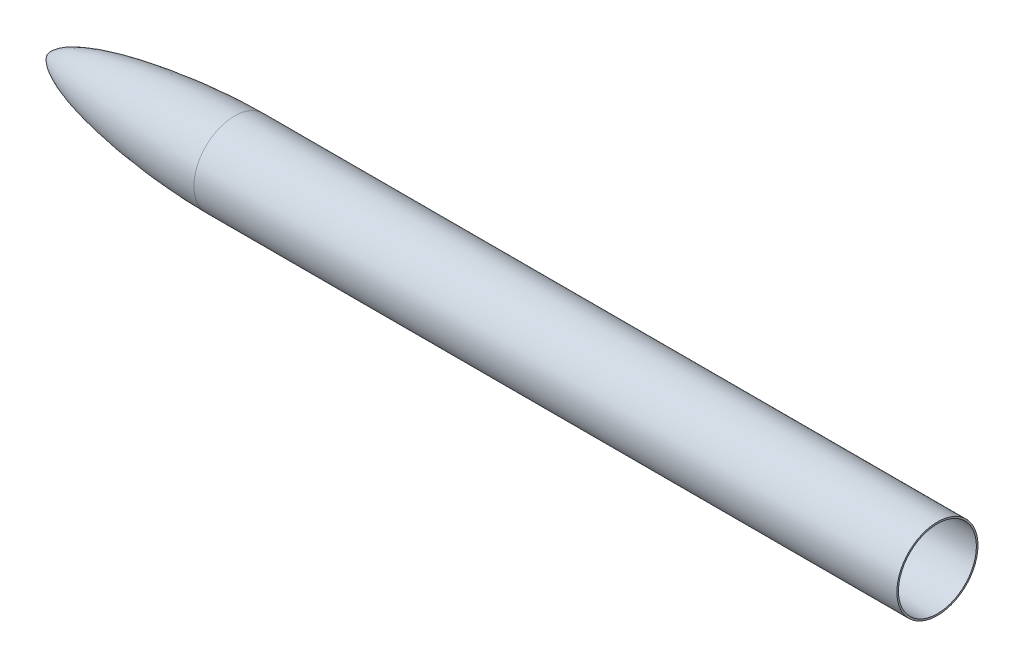
ISO-10303-21;
HEADER;
FILE_DESCRIPTION(('STEP AP214'),'2;1');
FILE_NAME('part.step','',(''),(''),'','','');
FILE_SCHEMA(('AUTOMOTIVE_DESIGN { 1 0 10303 214 1 1 1 1 }'));
ENDSEC;
DATA;
#1=APPLICATION_CONTEXT('core data for automotive mechanical design processes');
#2=APPLICATION_PROTOCOL_DEFINITION('international standard','automotive_design',2000,#1);
#3=PRODUCT_CONTEXT('',#1,'mechanical');
#4=PRODUCT('Part','Part','',(#3));
#5=PRODUCT_RELATED_PRODUCT_CATEGORY('part','',(#4));
#6=PRODUCT_DEFINITION_FORMATION('','',#4);
#7=PRODUCT_DEFINITION_CONTEXT('part definition',#1,'design');
#8=PRODUCT_DEFINITION('design','',#6,#7);
#9=PRODUCT_DEFINITION_SHAPE('','',#8);
#10=(LENGTH_UNIT() NAMED_UNIT(*) SI_UNIT(.MILLI.,.METRE.));
#11=(NAMED_UNIT(*) PLANE_ANGLE_UNIT() SI_UNIT($,.RADIAN.));
#12=(NAMED_UNIT(*) SI_UNIT($,.STERADIAN.) SOLID_ANGLE_UNIT());
#13=UNCERTAINTY_MEASURE_WITH_UNIT(LENGTH_MEASURE(1.E-05),#10,'distance_accuracy_value','');
#14=(GEOMETRIC_REPRESENTATION_CONTEXT(3) GLOBAL_UNCERTAINTY_ASSIGNED_CONTEXT((#13)) GLOBAL_UNIT_ASSIGNED_CONTEXT((#10,
#11,#12)) REPRESENTATION_CONTEXT('',''));
#15=CARTESIAN_POINT('',(0.,0.,0.));
#16=DIRECTION('',(0.,0.,1.));
#17=DIRECTION('',(1.,0.,0.));
#18=AXIS2_PLACEMENT_3D('',#15,#16,#17);
#19=CARTESIAN_POINT('',(220.,0.,0.));
#20=DIRECTION('',(-1.,0.,0.));
#21=DIRECTION('',(0.,0.,1.));
#22=AXIS2_PLACEMENT_3D('',#19,#20,#21);
#23=PLANE('',#22);
#24=CARTESIAN_POINT('',(220.,0.,0.));
#25=DIRECTION('',(1.,0.,0.));
#26=DIRECTION('',(0.,0.,-1.));
#27=AXIS2_PLACEMENT_3D('',#24,#25,#26);
#28=CIRCLE('',#27,24.4000000000001);
#29=CARTESIAN_POINT('',(220.,0.,-24.4));
#30=VERTEX_POINT('',#29);
#31=EDGE_CURVE('E13',#30,#30,#28,.T.);
#32=ORIENTED_EDGE('',*,*,#31,.F.);
#33=EDGE_LOOP('',(#32));
#34=FACE_BOUND('',#33,.T.);
#35=CARTESIAN_POINT('',(220.,0.,0.));
#36=DIRECTION('',(1.,0.,0.));
#37=DIRECTION('',(0.,0.,-1.));
#38=AXIS2_PLACEMENT_3D('',#35,#36,#37);
#39=CIRCLE('',#38,25.4000000000001);
#40=CARTESIAN_POINT('',(220.,0.,-25.4));
#41=VERTEX_POINT('',#40);
#42=EDGE_CURVE('E88',#41,#41,#39,.T.);
#43=ORIENTED_EDGE('',*,*,#42,.T.);
#44=EDGE_LOOP('',(#43));
#45=FACE_BOUND('',#44,.T.);
#46=ADVANCED_FACE('F48',(#34,#45),#23,.F.);
#47=CARTESIAN_POINT('',(-337.049147348303,0.,1.39775698315136E-13));
#48=DIRECTION('',(1.,0.,0.));
#49=DIRECTION('',(0.,0.,-1.));
#50=AXIS2_PLACEMENT_3D('',#47,#48,#49);
#51=CYLINDRICAL_SURFACE('',#50,24.4000000000001);
#52=ORIENTED_EDGE('',*,*,#31,.T.);
#53=EDGE_LOOP('',(#52));
#54=FACE_BOUND('',#53,.T.);
#55=CARTESIAN_POINT('',(-220.,0.,1.18265311011814E-13));
#56=DIRECTION('',(1.,0.,0.));
#57=DIRECTION('',(0.,0.,-1.));
#58=AXIS2_PLACEMENT_3D('',#55,#56,#57);
#59=CIRCLE('',#58,24.4000000000001);
#60=CARTESIAN_POINT('',(-220.,0.,-24.4));
#61=VERTEX_POINT('',#60);
#62=EDGE_CURVE('E59',#61,#61,#59,.T.);
#63=ORIENTED_EDGE('',*,*,#62,.F.);
#64=EDGE_LOOP('',(#63));
#65=FACE_BOUND('',#64,.T.);
#66=ADVANCED_FACE('F77',(#54,#65),#51,.F.);
#67=CARTESIAN_POINT('',(-336.833726567058,0.,-0.455562747311376));
#68=CARTESIAN_POINT('',(-328.725283762222,0.,-16.3000663360215));
#69=CARTESIAN_POINT('',(-259.546973057153,0.,-25.4));
#70=CARTESIAN_POINT('',(-220.,0.,-25.4));
#71=(BOUNDED_CURVE() B_SPLINE_CURVE(3,(#67,#68,#69,#70),.UNSPECIFIED.,.F.,
.F.) B_SPLINE_CURVE_WITH_KNOTS((4,4),(0.00945504107510813,1.),
.UNSPECIFIED.) CURVE() GEOMETRIC_REPRESENTATION_ITEM() RATIONAL_B_SPLINE_CURVE((1.,1.,1.,1.)) REPRESENTATION_ITEM(''));
#72=CARTESIAN_POINT('',(-337.049147348303,0.,1.39775698315136E-13));
#73=DIRECTION('',(1.,0.,0.));
#74=AXIS1_PLACEMENT('',#72,#73);
#75=SURFACE_OF_REVOLUTION('',#71,#74);
#76=OFFSET_SURFACE('',#75,-1.,.F.);
#77=CARTESIAN_POINT('',(-335.943522891901,0.,1.38994718512642E-13));
#78=VERTEX_POINT('',#77);
#79=VERTEX_LOOP('',#78);
#80=FACE_BOUND('',#79,.T.);
#81=ORIENTED_EDGE('',*,*,#62,.T.);
#82=EDGE_LOOP('',(#81));
#83=FACE_BOUND('',#82,.T.);
#84=ADVANCED_FACE('F72',(#80,#83),#76,.F.);
#85=CARTESIAN_POINT('',(-337.049147348303,0.,1.39775698315136E-13));
#86=DIRECTION('',(1.,0.,0.));
#87=DIRECTION('',(0.,0.,-1.));
#88=AXIS2_PLACEMENT_3D('',#85,#86,#87);
#89=CYLINDRICAL_SURFACE('',#88,25.4000000000001);
#90=ORIENTED_EDGE('',*,*,#42,.F.);
#91=EDGE_LOOP('',(#90));
#92=FACE_BOUND('',#91,.T.);
#93=CARTESIAN_POINT('',(-220.,0.,1.18265311011814E-13));
#94=DIRECTION('',(1.,0.,0.));
#95=DIRECTION('',(0.,0.,-1.));
#96=AXIS2_PLACEMENT_3D('',#93,#94,#95);
#97=CIRCLE('',#96,25.4000000000001);
#98=CARTESIAN_POINT('',(-220.,0.,-25.4));
#99=VERTEX_POINT('',#98);
#100=EDGE_CURVE('E89',#99,#99,#97,.T.);
#101=ORIENTED_EDGE('',*,*,#100,.T.);
#102=EDGE_LOOP('',(#101));
#103=FACE_BOUND('',#102,.T.);
#104=ADVANCED_FACE('F67',(#92,#103),#89,.T.);
#105=CARTESIAN_POINT('',(-337.049147348303,0.,0.));
#106=CARTESIAN_POINT('',(-330.048637930387,0.,-16.1255141656385));
#107=CARTESIAN_POINT('',(-259.924460470806,0.,-25.4));
#108=CARTESIAN_POINT('',(-220.,0.,-25.4));
#109=(BOUNDED_CURVE() B_SPLINE_CURVE(3,(#105,#106,#107,#108),.UNSPECIFIED.,.F.,
.F.) B_SPLINE_CURVE_WITH_KNOTS((4,4),(0.,1.),
.UNSPECIFIED.) CURVE() GEOMETRIC_REPRESENTATION_ITEM() RATIONAL_B_SPLINE_CURVE((1.,1.,1.,1.)) REPRESENTATION_ITEM(''));
#110=CARTESIAN_POINT('',(-337.049147348303,0.,1.39775698315136E-13));
#111=DIRECTION('',(1.,0.,0.));
#112=AXIS1_PLACEMENT('',#110,#111);
#113=SURFACE_OF_REVOLUTION('',#109,#112);
#114=ORIENTED_EDGE('',*,*,#100,.F.);
#115=EDGE_LOOP('',(#114));
#116=FACE_BOUND('',#115,.T.);
#117=CARTESIAN_POINT('',(-337.049147348303,0.,0.));
#118=VERTEX_POINT('',#117);
#119=VERTEX_LOOP('',#118);
#120=FACE_BOUND('',#119,.T.);
#121=ADVANCED_FACE('F65',(#116,#120),#113,.T.);
#122=CLOSED_SHELL('',(#46,#66,#84,#104,#121));
#123=MANIFOLD_SOLID_BREP('B2',#122);
#124=ADVANCED_BREP_SHAPE_REPRESENTATION('',(#18,#123),#14);
#125=SHAPE_DEFINITION_REPRESENTATION(#9,#124);
ENDSEC;
END-ISO-10303-21;
